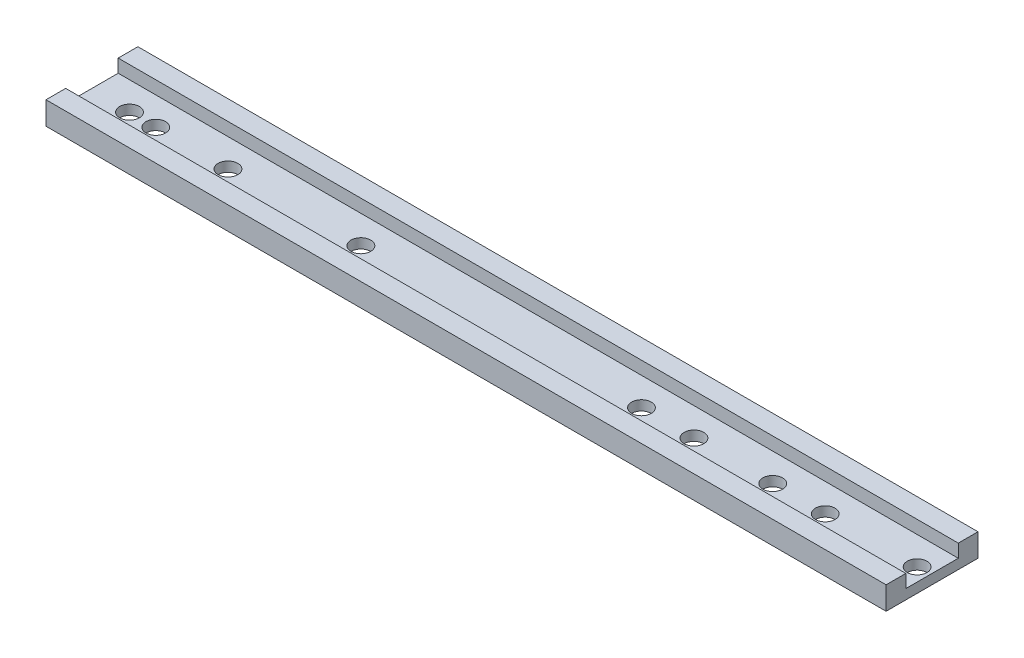
ISO-10303-21;
HEADER;
FILE_DESCRIPTION(('STEP AP214'),'2;1');
FILE_NAME('part.step','',(''),(''),'','','');
FILE_SCHEMA(('AUTOMOTIVE_DESIGN { 1 0 10303 214 1 1 1 1 }'));
ENDSEC;
DATA;
#1=APPLICATION_CONTEXT('core data for automotive mechanical design processes');
#2=APPLICATION_PROTOCOL_DEFINITION('international standard','automotive_design',2000,#1);
#3=PRODUCT_CONTEXT('',#1,'mechanical');
#4=PRODUCT('Part','Part','',(#3));
#5=PRODUCT_RELATED_PRODUCT_CATEGORY('part','',(#4));
#6=PRODUCT_DEFINITION_FORMATION('','',#4);
#7=PRODUCT_DEFINITION_CONTEXT('part definition',#1,'design');
#8=PRODUCT_DEFINITION('design','',#6,#7);
#9=PRODUCT_DEFINITION_SHAPE('','',#8);
#10=(LENGTH_UNIT() NAMED_UNIT(*) SI_UNIT(.MILLI.,.METRE.));
#11=(NAMED_UNIT(*) PLANE_ANGLE_UNIT() SI_UNIT($,.RADIAN.));
#12=(NAMED_UNIT(*) SI_UNIT($,.STERADIAN.) SOLID_ANGLE_UNIT());
#13=UNCERTAINTY_MEASURE_WITH_UNIT(LENGTH_MEASURE(1.E-05),#10,'distance_accuracy_value','');
#14=(GEOMETRIC_REPRESENTATION_CONTEXT(3) GLOBAL_UNCERTAINTY_ASSIGNED_CONTEXT((#13)) GLOBAL_UNIT_ASSIGNED_CONTEXT((#10,
#11,#12)) REPRESENTATION_CONTEXT('',''));
#15=CARTESIAN_POINT('',(0.,0.,0.));
#16=DIRECTION('',(0.,0.,1.));
#17=DIRECTION('',(1.,0.,0.));
#18=AXIS2_PLACEMENT_3D('',#15,#16,#17);
#19=CARTESIAN_POINT('',(211.2,6.88409090909091,11.825));
#20=DIRECTION('',(0.,-1.,0.));
#21=DIRECTION('',(0.,0.,-1.));
#22=AXIS2_PLACEMENT_3D('',#19,#20,#21);
#23=PLANE('',#22);
#24=DIRECTION('',(0.,0.,1.));
#25=VECTOR('',#24,1.);
#26=CARTESIAN_POINT('',(-195.2,6.88409090909091,11.825));
#27=LINE('',#26,#25);
#28=CARTESIAN_POINT('',(-195.2,6.88409090909091,11.825));
#29=VERTEX_POINT('',#28);
#30=CARTESIAN_POINT('',(-195.2,6.88409090909091,21.35));
#31=VERTEX_POINT('',#30);
#32=EDGE_CURVE('E133',#29,#31,#27,.T.);
#33=ORIENTED_EDGE('',*,*,#32,.T.);
#34=DIRECTION('',(-1.,0.,0.));
#35=VECTOR('',#34,1.);
#36=CARTESIAN_POINT('',(211.2,6.88409090909091,21.35));
#37=LINE('',#36,#35);
#38=CARTESIAN_POINT('',(211.2,6.88409090909091,21.35));
#39=VERTEX_POINT('',#38);
#40=EDGE_CURVE('E11',#39,#31,#37,.T.);
#41=ORIENTED_EDGE('',*,*,#40,.F.);
#42=DIRECTION('',(0.,0.,1.));
#43=VECTOR('',#42,1.);
#44=CARTESIAN_POINT('',(211.2,6.88409090909091,11.825));
#45=LINE('',#44,#43);
#46=CARTESIAN_POINT('',(211.2,6.88409090909091,11.825));
#47=VERTEX_POINT('',#46);
#48=EDGE_CURVE('E148',#47,#39,#45,.T.);
#49=ORIENTED_EDGE('',*,*,#48,.F.);
#50=DIRECTION('',(-1.,0.,0.));
#51=VECTOR('',#50,1.);
#52=CARTESIAN_POINT('',(211.2,6.88409090909091,11.825));
#53=LINE('',#52,#51);
#54=EDGE_CURVE('E129',#47,#29,#53,.T.);
#55=ORIENTED_EDGE('',*,*,#54,.T.);
#56=EDGE_LOOP('',(#33,#41,#49,#55));
#57=FACE_BOUND('',#56,.T.);
#58=ADVANCED_FACE('F35',(#57),#23,.F.);
#59=CARTESIAN_POINT('',(211.2,6.88409090909091,21.35));
#60=DIRECTION('',(0.,0.,-1.));
#61=DIRECTION('',(-1.,0.,0.));
#62=AXIS2_PLACEMENT_3D('',#59,#60,#61);
#63=PLANE('',#62);
#64=DIRECTION('',(0.,-1.,0.));
#65=VECTOR('',#64,1.);
#66=CARTESIAN_POINT('',(-195.2,6.88409090909091,21.35));
#67=LINE('',#66,#65);
#68=CARTESIAN_POINT('',(-195.2,-4.22840909090909,21.35));
#69=VERTEX_POINT('',#68);
#70=EDGE_CURVE('E136',#31,#69,#67,.T.);
#71=ORIENTED_EDGE('',*,*,#70,.T.);
#72=DIRECTION('',(-1.,0.,0.));
#73=VECTOR('',#72,1.);
#74=CARTESIAN_POINT('',(211.2,-4.22840909090909,21.35));
#75=LINE('',#74,#73);
#76=CARTESIAN_POINT('',(211.2,-4.22840909090909,21.35));
#77=VERTEX_POINT('',#76);
#78=EDGE_CURVE('E44',#77,#69,#75,.T.);
#79=ORIENTED_EDGE('',*,*,#78,.F.);
#80=DIRECTION('',(0.,-1.,0.));
#81=VECTOR('',#80,1.);
#82=CARTESIAN_POINT('',(211.2,6.88409090909091,21.35));
#83=LINE('',#82,#81);
#84=EDGE_CURVE('E96',#39,#77,#83,.T.);
#85=ORIENTED_EDGE('',*,*,#84,.F.);
#86=ORIENTED_EDGE('',*,*,#40,.T.);
#87=EDGE_LOOP('',(#71,#79,#85,#86));
#88=FACE_BOUND('',#87,.T.);
#89=ADVANCED_FACE('F247',(#88),#63,.F.);
#90=CARTESIAN_POINT('',(211.2,-4.22840909090909,21.35));
#91=DIRECTION('',(0.,1.,0.));
#92=DIRECTION('',(0.,0.,1.));
#93=AXIS2_PLACEMENT_3D('',#90,#91,#92);
#94=PLANE('',#93);
#95=CARTESIAN_POINT('',(204.85,-4.22840909090909,0.));
#96=DIRECTION('',(0.,-1.,0.));
#97=DIRECTION('',(0.,0.,-1.));
#98=AXIS2_PLACEMENT_3D('',#95,#96,#97);
#99=CIRCLE('',#98,4.76250000000001);
#100=CARTESIAN_POINT('',(204.85,-4.22840909090909,-4.76250000000001));
#101=VERTEX_POINT('',#100);
#102=EDGE_CURVE('E198',#101,#101,#99,.T.);
#103=ORIENTED_EDGE('',*,*,#102,.F.);
#104=EDGE_LOOP('',(#103));
#105=FACE_BOUND('',#104,.T.);
#106=CARTESIAN_POINT('',(160.4,-4.22840909090909,0.));
#107=DIRECTION('',(0.,-1.,0.));
#108=DIRECTION('',(0.,0.,-1.));
#109=AXIS2_PLACEMENT_3D('',#106,#107,#108);
#110=CIRCLE('',#109,4.76250000000001);
#111=CARTESIAN_POINT('',(160.4,-4.22840909090909,-4.76250000000001));
#112=VERTEX_POINT('',#111);
#113=EDGE_CURVE('E188',#112,#112,#110,.T.);
#114=ORIENTED_EDGE('',*,*,#113,.F.);
#115=EDGE_LOOP('',(#114));
#116=FACE_BOUND('',#115,.T.);
#117=CARTESIAN_POINT('',(135.,-4.22840909090909,0.));
#118=DIRECTION('',(0.,-1.,0.));
#119=DIRECTION('',(0.,0.,-1.));
#120=AXIS2_PLACEMENT_3D('',#117,#118,#119);
#121=CIRCLE('',#120,4.76250000000001);
#122=CARTESIAN_POINT('',(135.,-4.22840909090909,-4.76250000000001));
#123=VERTEX_POINT('',#122);
#124=EDGE_CURVE('E185',#123,#123,#121,.T.);
#125=ORIENTED_EDGE('',*,*,#124,.F.);
#126=EDGE_LOOP('',(#125));
#127=FACE_BOUND('',#126,.T.);
#128=CARTESIAN_POINT('',(96.9,-4.22840909090909,0.));
#129=DIRECTION('',(0.,-1.,0.));
#130=DIRECTION('',(0.,0.,-1.));
#131=AXIS2_PLACEMENT_3D('',#128,#129,#130);
#132=CIRCLE('',#131,4.7625);
#133=CARTESIAN_POINT('',(96.9,-4.22840909090909,-4.7625));
#134=VERTEX_POINT('',#133);
#135=EDGE_CURVE('E182',#134,#134,#132,.T.);
#136=ORIENTED_EDGE('',*,*,#135,.F.);
#137=EDGE_LOOP('',(#136));
#138=FACE_BOUND('',#137,.T.);
#139=CARTESIAN_POINT('',(71.5,-4.22840909090909,0.));
#140=DIRECTION('',(0.,-1.,0.));
#141=DIRECTION('',(0.,0.,-1.));
#142=AXIS2_PLACEMENT_3D('',#139,#140,#141);
#143=CIRCLE('',#142,4.7625);
#144=CARTESIAN_POINT('',(71.5,-4.22840909090909,-4.7625));
#145=VERTEX_POINT('',#144);
#146=EDGE_CURVE('E178',#145,#145,#143,.T.);
#147=ORIENTED_EDGE('',*,*,#146,.F.);
#148=EDGE_LOOP('',(#147));
#149=FACE_BOUND('',#148,.T.);
#150=CARTESIAN_POINT('',(-64.23125,-4.22840909090909,0.));
#151=DIRECTION('',(0.,-1.,0.));
#152=DIRECTION('',(0.,0.,-1.));
#153=AXIS2_PLACEMENT_3D('',#150,#151,#152);
#154=CIRCLE('',#153,4.7625);
#155=CARTESIAN_POINT('',(-64.23125,-4.22840909090909,-4.7625));
#156=VERTEX_POINT('',#155);
#157=EDGE_CURVE('E174',#156,#156,#154,.T.);
#158=ORIENTED_EDGE('',*,*,#157,.F.);
#159=EDGE_LOOP('',(#158));
#160=FACE_BOUND('',#159,.T.);
#161=CARTESIAN_POINT('',(-128.525,-4.22840909090909,0.));
#162=DIRECTION('',(0.,-1.,0.));
#163=DIRECTION('',(0.,0.,-1.));
#164=AXIS2_PLACEMENT_3D('',#161,#162,#163);
#165=CIRCLE('',#164,4.7625);
#166=CARTESIAN_POINT('',(-128.525,-4.22840909090909,-4.7625));
#167=VERTEX_POINT('',#166);
#168=EDGE_CURVE('E170',#167,#167,#165,.T.);
#169=ORIENTED_EDGE('',*,*,#168,.F.);
#170=EDGE_LOOP('',(#169));
#171=FACE_BOUND('',#170,.T.);
#172=CARTESIAN_POINT('',(-163.45,-4.22840909090909,0.));
#173=DIRECTION('',(0.,-1.,0.));
#174=DIRECTION('',(0.,0.,-1.));
#175=AXIS2_PLACEMENT_3D('',#172,#173,#174);
#176=CIRCLE('',#175,4.76250000000001);
#177=CARTESIAN_POINT('',(-163.45,-4.22840909090909,-4.76250000000001));
#178=VERTEX_POINT('',#177);
#179=EDGE_CURVE('E166',#178,#178,#176,.T.);
#180=ORIENTED_EDGE('',*,*,#179,.F.);
#181=EDGE_LOOP('',(#180));
#182=FACE_BOUND('',#181,.T.);
#183=CARTESIAN_POINT('',(-176.15,-4.22840909090909,0.));
#184=DIRECTION('',(0.,-1.,0.));
#185=DIRECTION('',(0.,0.,-1.));
#186=AXIS2_PLACEMENT_3D('',#183,#184,#185);
#187=CIRCLE('',#186,4.76250000000001);
#188=CARTESIAN_POINT('',(-176.15,-4.22840909090909,-4.76250000000001));
#189=VERTEX_POINT('',#188);
#190=EDGE_CURVE('E162',#189,#189,#187,.T.);
#191=ORIENTED_EDGE('',*,*,#190,.F.);
#192=EDGE_LOOP('',(#191));
#193=FACE_BOUND('',#192,.T.);
#194=DIRECTION('',(0.,0.,-1.));
#195=VECTOR('',#194,1.);
#196=CARTESIAN_POINT('',(-195.2,-4.22840909090909,21.35));
#197=LINE('',#196,#195);
#198=CARTESIAN_POINT('',(-195.2,-4.22840909090909,-23.1));
#199=VERTEX_POINT('',#198);
#200=EDGE_CURVE('E139',#69,#199,#197,.T.);
#201=ORIENTED_EDGE('',*,*,#200,.T.);
#202=DIRECTION('',(-1.,0.,0.));
#203=VECTOR('',#202,1.);
#204=CARTESIAN_POINT('',(211.2,-4.22840909090909,-23.1));
#205=LINE('',#204,#203);
#206=CARTESIAN_POINT('',(211.2,-4.22840909090909,-23.1));
#207=VERTEX_POINT('',#206);
#208=EDGE_CURVE('E155',#207,#199,#205,.T.);
#209=ORIENTED_EDGE('',*,*,#208,.F.);
#210=DIRECTION('',(0.,0.,-1.));
#211=VECTOR('',#210,1.);
#212=CARTESIAN_POINT('',(211.2,-4.22840909090909,21.35));
#213=LINE('',#212,#211);
#214=EDGE_CURVE('E215',#77,#207,#213,.T.);
#215=ORIENTED_EDGE('',*,*,#214,.F.);
#216=ORIENTED_EDGE('',*,*,#78,.T.);
#217=EDGE_LOOP('',(#201,#209,#215,#216));
#218=FACE_BOUND('',#217,.T.);
#219=ADVANCED_FACE('F251',(#105,#116,#127,#138,#149,#160,#171,#182,#193,#218),#94,.F.);
#220=CARTESIAN_POINT('',(211.2,-4.22840909090909,-23.1));
#221=DIRECTION('',(0.,0.,1.));
#222=DIRECTION('',(0.,-1.,0.));
#223=AXIS2_PLACEMENT_3D('',#220,#221,#222);
#224=PLANE('',#223);
#225=DIRECTION('',(0.,1.,0.));
#226=VECTOR('',#225,1.);
#227=CARTESIAN_POINT('',(-195.2,-4.22840909090909,-23.1));
#228=LINE('',#227,#226);
#229=CARTESIAN_POINT('',(-195.2,6.88409090909091,-23.1));
#230=VERTEX_POINT('',#229);
#231=EDGE_CURVE('E141',#199,#230,#228,.T.);
#232=ORIENTED_EDGE('',*,*,#231,.T.);
#233=DIRECTION('',(-1.,0.,0.));
#234=VECTOR('',#233,1.);
#235=CARTESIAN_POINT('',(211.2,6.88409090909091,-23.1));
#236=LINE('',#235,#234);
#237=CARTESIAN_POINT('',(211.2,6.88409090909091,-23.1));
#238=VERTEX_POINT('',#237);
#239=EDGE_CURVE('E152',#238,#230,#236,.T.);
#240=ORIENTED_EDGE('',*,*,#239,.F.);
#241=DIRECTION('',(0.,1.,0.));
#242=VECTOR('',#241,1.);
#243=CARTESIAN_POINT('',(211.2,-4.22840909090909,-23.1));
#244=LINE('',#243,#242);
#245=EDGE_CURVE('E217',#207,#238,#244,.T.);
#246=ORIENTED_EDGE('',*,*,#245,.F.);
#247=ORIENTED_EDGE('',*,*,#208,.T.);
#248=EDGE_LOOP('',(#232,#240,#246,#247));
#249=FACE_BOUND('',#248,.T.);
#250=ADVANCED_FACE('F223',(#249),#224,.F.);
#251=CARTESIAN_POINT('',(211.2,6.88409090909091,-23.1));
#252=DIRECTION('',(0.,-1.,0.));
#253=DIRECTION('',(0.,0.,-1.));
#254=AXIS2_PLACEMENT_3D('',#251,#252,#253);
#255=PLANE('',#254);
#256=DIRECTION('',(0.,0.,1.));
#257=VECTOR('',#256,1.);
#258=CARTESIAN_POINT('',(-195.2,6.88409090909091,-23.1));
#259=LINE('',#258,#257);
#260=CARTESIAN_POINT('',(-195.2,6.88409090909091,-13.575));
#261=VERTEX_POINT('',#260);
#262=EDGE_CURVE('E143',#230,#261,#259,.T.);
#263=ORIENTED_EDGE('',*,*,#262,.T.);
#264=DIRECTION('',(-1.,0.,0.));
#265=VECTOR('',#264,1.);
#266=CARTESIAN_POINT('',(211.2,6.88409090909091,-13.575));
#267=LINE('',#266,#265);
#268=CARTESIAN_POINT('',(211.2,6.88409090909091,-13.575));
#269=VERTEX_POINT('',#268);
#270=EDGE_CURVE('E124',#269,#261,#267,.T.);
#271=ORIENTED_EDGE('',*,*,#270,.F.);
#272=DIRECTION('',(0.,0.,1.));
#273=VECTOR('',#272,1.);
#274=CARTESIAN_POINT('',(211.2,6.88409090909091,-23.1));
#275=LINE('',#274,#273);
#276=EDGE_CURVE('E115',#238,#269,#275,.T.);
#277=ORIENTED_EDGE('',*,*,#276,.F.);
#278=ORIENTED_EDGE('',*,*,#239,.T.);
#279=EDGE_LOOP('',(#263,#271,#277,#278));
#280=FACE_BOUND('',#279,.T.);
#281=ADVANCED_FACE('F227',(#280),#255,.F.);
#282=CARTESIAN_POINT('',(211.2,6.88409090909091,-13.575));
#283=DIRECTION('',(0.,0.,-1.));
#284=DIRECTION('',(0.,1.,0.));
#285=AXIS2_PLACEMENT_3D('',#282,#283,#284);
#286=PLANE('',#285);
#287=DIRECTION('',(0.,-1.,0.));
#288=VECTOR('',#287,1.);
#289=CARTESIAN_POINT('',(-195.2,6.88409090909091,-13.575));
#290=LINE('',#289,#288);
#291=CARTESIAN_POINT('',(-195.2,0.534090909090912,-13.575));
#292=VERTEX_POINT('',#291);
#293=EDGE_CURVE('E123',#261,#292,#290,.T.);
#294=ORIENTED_EDGE('',*,*,#293,.T.);
#295=DIRECTION('',(-1.,0.,0.));
#296=VECTOR('',#295,1.);
#297=CARTESIAN_POINT('',(211.2,0.534090909090912,-13.575));
#298=LINE('',#297,#296);
#299=CARTESIAN_POINT('',(211.2,0.534090909090912,-13.575));
#300=VERTEX_POINT('',#299);
#301=EDGE_CURVE('E120',#300,#292,#298,.T.);
#302=ORIENTED_EDGE('',*,*,#301,.F.);
#303=DIRECTION('',(0.,-1.,0.));
#304=VECTOR('',#303,1.);
#305=CARTESIAN_POINT('',(211.2,6.88409090909091,-13.575));
#306=LINE('',#305,#304);
#307=EDGE_CURVE('E109',#269,#300,#306,.T.);
#308=ORIENTED_EDGE('',*,*,#307,.F.);
#309=ORIENTED_EDGE('',*,*,#270,.T.);
#310=EDGE_LOOP('',(#294,#302,#308,#309));
#311=FACE_BOUND('',#310,.T.);
#312=ADVANCED_FACE('F121',(#311),#286,.F.);
#313=CARTESIAN_POINT('',(211.2,0.534090909090912,-13.575));
#314=DIRECTION('',(0.,-1.,0.));
#315=DIRECTION('',(0.,0.,-1.));
#316=AXIS2_PLACEMENT_3D('',#313,#314,#315);
#317=PLANE('',#316);
#318=CARTESIAN_POINT('',(204.85,0.53409090909091,0.));
#319=DIRECTION('',(0.,-1.,0.));
#320=DIRECTION('',(0.,0.,-1.));
#321=AXIS2_PLACEMENT_3D('',#318,#319,#320);
#322=CIRCLE('',#321,4.76250000000001);
#323=CARTESIAN_POINT('',(204.85,0.534090909090911,-4.76250000000001));
#324=VERTEX_POINT('',#323);
#325=EDGE_CURVE('E38',#324,#324,#322,.T.);
#326=ORIENTED_EDGE('',*,*,#325,.T.);
#327=EDGE_LOOP('',(#326));
#328=FACE_BOUND('',#327,.T.);
#329=CARTESIAN_POINT('',(160.4,0.53409090909091,0.));
#330=DIRECTION('',(0.,-1.,0.));
#331=DIRECTION('',(0.,0.,-1.));
#332=AXIS2_PLACEMENT_3D('',#329,#330,#331);
#333=CIRCLE('',#332,4.76250000000001);
#334=CARTESIAN_POINT('',(160.4,0.534090909090911,-4.76250000000001));
#335=VERTEX_POINT('',#334);
#336=EDGE_CURVE('E186',#335,#335,#333,.T.);
#337=ORIENTED_EDGE('',*,*,#336,.T.);
#338=EDGE_LOOP('',(#337));
#339=FACE_BOUND('',#338,.T.);
#340=CARTESIAN_POINT('',(135.,0.53409090909091,0.));
#341=DIRECTION('',(0.,-1.,0.));
#342=DIRECTION('',(0.,0.,-1.));
#343=AXIS2_PLACEMENT_3D('',#340,#341,#342);
#344=CIRCLE('',#343,4.76250000000001);
#345=CARTESIAN_POINT('',(135.,0.534090909090911,-4.76250000000001));
#346=VERTEX_POINT('',#345);
#347=EDGE_CURVE('E183',#346,#346,#344,.T.);
#348=ORIENTED_EDGE('',*,*,#347,.T.);
#349=EDGE_LOOP('',(#348));
#350=FACE_BOUND('',#349,.T.);
#351=CARTESIAN_POINT('',(96.9,0.53409090909091,0.));
#352=DIRECTION('',(0.,-1.,0.));
#353=DIRECTION('',(0.,0.,-1.));
#354=AXIS2_PLACEMENT_3D('',#351,#352,#353);
#355=CIRCLE('',#354,4.7625);
#356=CARTESIAN_POINT('',(96.9,0.534090909090911,-4.7625));
#357=VERTEX_POINT('',#356);
#358=EDGE_CURVE('E179',#357,#357,#355,.T.);
#359=ORIENTED_EDGE('',*,*,#358,.T.);
#360=EDGE_LOOP('',(#359));
#361=FACE_BOUND('',#360,.T.);
#362=CARTESIAN_POINT('',(71.5,0.53409090909091,0.));
#363=DIRECTION('',(0.,-1.,0.));
#364=DIRECTION('',(0.,0.,-1.));
#365=AXIS2_PLACEMENT_3D('',#362,#363,#364);
#366=CIRCLE('',#365,4.7625);
#367=CARTESIAN_POINT('',(71.5,0.534090909090911,-4.7625));
#368=VERTEX_POINT('',#367);
#369=EDGE_CURVE('E175',#368,#368,#366,.T.);
#370=ORIENTED_EDGE('',*,*,#369,.T.);
#371=EDGE_LOOP('',(#370));
#372=FACE_BOUND('',#371,.T.);
#373=CARTESIAN_POINT('',(-64.23125,0.53409090909091,0.));
#374=DIRECTION('',(0.,-1.,0.));
#375=DIRECTION('',(0.,0.,-1.));
#376=AXIS2_PLACEMENT_3D('',#373,#374,#375);
#377=CIRCLE('',#376,4.7625);
#378=CARTESIAN_POINT('',(-64.23125,0.534090909090911,-4.7625));
#379=VERTEX_POINT('',#378);
#380=EDGE_CURVE('E171',#379,#379,#377,.T.);
#381=ORIENTED_EDGE('',*,*,#380,.T.);
#382=EDGE_LOOP('',(#381));
#383=FACE_BOUND('',#382,.T.);
#384=CARTESIAN_POINT('',(-128.525,0.53409090909091,0.));
#385=DIRECTION('',(0.,-1.,0.));
#386=DIRECTION('',(0.,0.,-1.));
#387=AXIS2_PLACEMENT_3D('',#384,#385,#386);
#388=CIRCLE('',#387,4.7625);
#389=CARTESIAN_POINT('',(-128.525,0.534090909090911,-4.7625));
#390=VERTEX_POINT('',#389);
#391=EDGE_CURVE('E167',#390,#390,#388,.T.);
#392=ORIENTED_EDGE('',*,*,#391,.T.);
#393=EDGE_LOOP('',(#392));
#394=FACE_BOUND('',#393,.T.);
#395=CARTESIAN_POINT('',(-163.45,0.53409090909091,0.));
#396=DIRECTION('',(0.,-1.,0.));
#397=DIRECTION('',(0.,0.,-1.));
#398=AXIS2_PLACEMENT_3D('',#395,#396,#397);
#399=CIRCLE('',#398,4.76250000000001);
#400=CARTESIAN_POINT('',(-163.45,0.534090909090911,-4.76250000000001));
#401=VERTEX_POINT('',#400);
#402=EDGE_CURVE('E163',#401,#401,#399,.T.);
#403=ORIENTED_EDGE('',*,*,#402,.T.);
#404=EDGE_LOOP('',(#403));
#405=FACE_BOUND('',#404,.T.);
#406=CARTESIAN_POINT('',(-176.15,0.53409090909091,0.));
#407=DIRECTION('',(0.,-1.,0.));
#408=DIRECTION('',(0.,0.,-1.));
#409=AXIS2_PLACEMENT_3D('',#406,#407,#408);
#410=CIRCLE('',#409,4.76250000000001);
#411=CARTESIAN_POINT('',(-176.15,0.534090909090911,-4.76250000000001));
#412=VERTEX_POINT('',#411);
#413=EDGE_CURVE('E137',#412,#412,#410,.T.);
#414=ORIENTED_EDGE('',*,*,#413,.T.);
#415=EDGE_LOOP('',(#414));
#416=FACE_BOUND('',#415,.T.);
#417=DIRECTION('',(0.,0.,1.));
#418=VECTOR('',#417,1.);
#419=CARTESIAN_POINT('',(-195.2,0.534090909090912,-13.575));
#420=LINE('',#419,#418);
#421=CARTESIAN_POINT('',(-195.2,0.534090909090908,11.825));
#422=VERTEX_POINT('',#421);
#423=EDGE_CURVE('E82',#292,#422,#420,.T.);
#424=ORIENTED_EDGE('',*,*,#423,.T.);
#425=DIRECTION('',(-1.,0.,0.));
#426=VECTOR('',#425,1.);
#427=CARTESIAN_POINT('',(211.2,0.534090909090908,11.825));
#428=LINE('',#427,#426);
#429=CARTESIAN_POINT('',(211.2,0.534090909090908,11.825));
#430=VERTEX_POINT('',#429);
#431=EDGE_CURVE('E125',#430,#422,#428,.T.);
#432=ORIENTED_EDGE('',*,*,#431,.F.);
#433=DIRECTION('',(0.,0.,1.));
#434=VECTOR('',#433,1.);
#435=CARTESIAN_POINT('',(211.2,0.534090909090912,-13.575));
#436=LINE('',#435,#434);
#437=EDGE_CURVE('E113',#300,#430,#436,.T.);
#438=ORIENTED_EDGE('',*,*,#437,.F.);
#439=ORIENTED_EDGE('',*,*,#301,.T.);
#440=EDGE_LOOP('',(#424,#432,#438,#439));
#441=FACE_BOUND('',#440,.T.);
#442=ADVANCED_FACE('F127',(#328,#339,#350,#361,#372,#383,#394,#405,#416,#441),#317,.F.);
#443=CARTESIAN_POINT('',(211.2,0.534090909090908,11.825));
#444=DIRECTION('',(0.,0.,1.));
#445=DIRECTION('',(0.,-1.,0.));
#446=AXIS2_PLACEMENT_3D('',#443,#444,#445);
#447=PLANE('',#446);
#448=DIRECTION('',(0.,1.,0.));
#449=VECTOR('',#448,1.);
#450=CARTESIAN_POINT('',(-195.2,0.534090909090908,11.825));
#451=LINE('',#450,#449);
#452=EDGE_CURVE('E88',#422,#29,#451,.T.);
#453=ORIENTED_EDGE('',*,*,#452,.T.);
#454=ORIENTED_EDGE('',*,*,#54,.F.);
#455=DIRECTION('',(0.,1.,0.));
#456=VECTOR('',#455,1.);
#457=CARTESIAN_POINT('',(211.2,0.534090909090908,11.825));
#458=LINE('',#457,#456);
#459=EDGE_CURVE('E53',#430,#47,#458,.T.);
#460=ORIENTED_EDGE('',*,*,#459,.F.);
#461=ORIENTED_EDGE('',*,*,#431,.T.);
#462=EDGE_LOOP('',(#453,#454,#460,#461));
#463=FACE_BOUND('',#462,.T.);
#464=ADVANCED_FACE('F235',(#463),#447,.F.);
#465=CARTESIAN_POINT('',(211.2,-4.22840909090909,21.35));
#466=DIRECTION('',(1.,0.,0.));
#467=DIRECTION('',(0.,0.,-1.));
#468=AXIS2_PLACEMENT_3D('',#465,#466,#467);
#469=PLANE('',#468);
#470=ORIENTED_EDGE('',*,*,#48,.T.);
#471=ORIENTED_EDGE('',*,*,#84,.T.);
#472=ORIENTED_EDGE('',*,*,#214,.T.);
#473=ORIENTED_EDGE('',*,*,#245,.T.);
#474=ORIENTED_EDGE('',*,*,#276,.T.);
#475=ORIENTED_EDGE('',*,*,#307,.T.);
#476=ORIENTED_EDGE('',*,*,#437,.T.);
#477=ORIENTED_EDGE('',*,*,#459,.T.);
#478=EDGE_LOOP('',(#470,#471,#472,#473,#474,#475,#476,#477));
#479=FACE_BOUND('',#478,.T.);
#480=ADVANCED_FACE('F111',(#479),#469,.T.);
#481=CARTESIAN_POINT('',(-195.2,-4.22840909090909,21.35));
#482=DIRECTION('',(1.,0.,0.));
#483=DIRECTION('',(0.,0.,-1.));
#484=AXIS2_PLACEMENT_3D('',#481,#482,#483);
#485=PLANE('',#484);
#486=ORIENTED_EDGE('',*,*,#32,.F.);
#487=ORIENTED_EDGE('',*,*,#452,.F.);
#488=ORIENTED_EDGE('',*,*,#423,.F.);
#489=ORIENTED_EDGE('',*,*,#293,.F.);
#490=ORIENTED_EDGE('',*,*,#262,.F.);
#491=ORIENTED_EDGE('',*,*,#231,.F.);
#492=ORIENTED_EDGE('',*,*,#200,.F.);
#493=ORIENTED_EDGE('',*,*,#70,.F.);
#494=EDGE_LOOP('',(#486,#487,#488,#489,#490,#491,#492,#493));
#495=FACE_BOUND('',#494,.T.);
#496=ADVANCED_FACE('F230',(#495),#485,.F.);
#497=CARTESIAN_POINT('',(-176.15,6.88409090909091,0.));
#498=DIRECTION('',(0.,-1.,0.));
#499=DIRECTION('',(0.,0.,-1.));
#500=AXIS2_PLACEMENT_3D('',#497,#498,#499);
#501=CYLINDRICAL_SURFACE('',#500,4.76250000000001);
#502=ORIENTED_EDGE('',*,*,#190,.T.);
#503=EDGE_LOOP('',(#502));
#504=FACE_BOUND('',#503,.T.);
#505=ORIENTED_EDGE('',*,*,#413,.F.);
#506=EDGE_LOOP('',(#505));
#507=FACE_BOUND('',#506,.T.);
#508=ADVANCED_FACE('F281',(#504,#507),#501,.F.);
#509=CARTESIAN_POINT('',(-163.45,6.88409090909091,0.));
#510=DIRECTION('',(0.,-1.,0.));
#511=DIRECTION('',(0.,0.,-1.));
#512=AXIS2_PLACEMENT_3D('',#509,#510,#511);
#513=CYLINDRICAL_SURFACE('',#512,4.76250000000001);
#514=ORIENTED_EDGE('',*,*,#179,.T.);
#515=EDGE_LOOP('',(#514));
#516=FACE_BOUND('',#515,.T.);
#517=ORIENTED_EDGE('',*,*,#402,.F.);
#518=EDGE_LOOP('',(#517));
#519=FACE_BOUND('',#518,.T.);
#520=ADVANCED_FACE('F286',(#516,#519),#513,.F.);
#521=CARTESIAN_POINT('',(-128.525,6.88409090909091,0.));
#522=DIRECTION('',(0.,-1.,0.));
#523=DIRECTION('',(0.,0.,-1.));
#524=AXIS2_PLACEMENT_3D('',#521,#522,#523);
#525=CYLINDRICAL_SURFACE('',#524,4.7625);
#526=ORIENTED_EDGE('',*,*,#168,.T.);
#527=EDGE_LOOP('',(#526));
#528=FACE_BOUND('',#527,.T.);
#529=ORIENTED_EDGE('',*,*,#391,.F.);
#530=EDGE_LOOP('',(#529));
#531=FACE_BOUND('',#530,.T.);
#532=ADVANCED_FACE('F298',(#528,#531),#525,.F.);
#533=CARTESIAN_POINT('',(-64.23125,6.88409090909091,0.));
#534=DIRECTION('',(0.,-1.,0.));
#535=DIRECTION('',(0.,0.,-1.));
#536=AXIS2_PLACEMENT_3D('',#533,#534,#535);
#537=CYLINDRICAL_SURFACE('',#536,4.7625);
#538=ORIENTED_EDGE('',*,*,#157,.T.);
#539=EDGE_LOOP('',(#538));
#540=FACE_BOUND('',#539,.T.);
#541=ORIENTED_EDGE('',*,*,#380,.F.);
#542=EDGE_LOOP('',(#541));
#543=FACE_BOUND('',#542,.T.);
#544=ADVANCED_FACE('F308',(#540,#543),#537,.F.);
#545=CARTESIAN_POINT('',(71.5,6.88409090909091,0.));
#546=DIRECTION('',(0.,-1.,0.));
#547=DIRECTION('',(0.,0.,-1.));
#548=AXIS2_PLACEMENT_3D('',#545,#546,#547);
#549=CYLINDRICAL_SURFACE('',#548,4.7625);
#550=ORIENTED_EDGE('',*,*,#146,.T.);
#551=EDGE_LOOP('',(#550));
#552=FACE_BOUND('',#551,.T.);
#553=ORIENTED_EDGE('',*,*,#369,.F.);
#554=EDGE_LOOP('',(#553));
#555=FACE_BOUND('',#554,.T.);
#556=ADVANCED_FACE('F318',(#552,#555),#549,.F.);
#557=CARTESIAN_POINT('',(96.9,6.88409090909091,0.));
#558=DIRECTION('',(0.,-1.,0.));
#559=DIRECTION('',(0.,0.,-1.));
#560=AXIS2_PLACEMENT_3D('',#557,#558,#559);
#561=CYLINDRICAL_SURFACE('',#560,4.7625);
#562=ORIENTED_EDGE('',*,*,#135,.T.);
#563=EDGE_LOOP('',(#562));
#564=FACE_BOUND('',#563,.T.);
#565=ORIENTED_EDGE('',*,*,#358,.F.);
#566=EDGE_LOOP('',(#565));
#567=FACE_BOUND('',#566,.T.);
#568=ADVANCED_FACE('F328',(#564,#567),#561,.F.);
#569=CARTESIAN_POINT('',(135.,6.88409090909091,0.));
#570=DIRECTION('',(0.,-1.,0.));
#571=DIRECTION('',(0.,0.,-1.));
#572=AXIS2_PLACEMENT_3D('',#569,#570,#571);
#573=CYLINDRICAL_SURFACE('',#572,4.76250000000001);
#574=ORIENTED_EDGE('',*,*,#124,.T.);
#575=EDGE_LOOP('',(#574));
#576=FACE_BOUND('',#575,.T.);
#577=ORIENTED_EDGE('',*,*,#347,.F.);
#578=EDGE_LOOP('',(#577));
#579=FACE_BOUND('',#578,.T.);
#580=ADVANCED_FACE('F338',(#576,#579),#573,.F.);
#581=CARTESIAN_POINT('',(160.4,6.88409090909091,0.));
#582=DIRECTION('',(0.,-1.,0.));
#583=DIRECTION('',(0.,0.,-1.));
#584=AXIS2_PLACEMENT_3D('',#581,#582,#583);
#585=CYLINDRICAL_SURFACE('',#584,4.76250000000001);
#586=ORIENTED_EDGE('',*,*,#113,.T.);
#587=EDGE_LOOP('',(#586));
#588=FACE_BOUND('',#587,.T.);
#589=ORIENTED_EDGE('',*,*,#336,.F.);
#590=EDGE_LOOP('',(#589));
#591=FACE_BOUND('',#590,.T.);
#592=ADVANCED_FACE('F348',(#588,#591),#585,.F.);
#593=CARTESIAN_POINT('',(204.85,6.88409090909091,0.));
#594=DIRECTION('',(0.,-1.,0.));
#595=DIRECTION('',(0.,0.,-1.));
#596=AXIS2_PLACEMENT_3D('',#593,#594,#595);
#597=CYLINDRICAL_SURFACE('',#596,4.76250000000001);
#598=ORIENTED_EDGE('',*,*,#102,.T.);
#599=EDGE_LOOP('',(#598));
#600=FACE_BOUND('',#599,.T.);
#601=ORIENTED_EDGE('',*,*,#325,.F.);
#602=EDGE_LOOP('',(#601));
#603=FACE_BOUND('',#602,.T.);
#604=ADVANCED_FACE('F358',(#600,#603),#597,.F.);
#605=CLOSED_SHELL('',(#58,#89,#219,#250,#281,#312,#442,#464,#480,#496,#508,#520,#532,#544,#556,
#568,#580,#592,#604));
#606=MANIFOLD_SOLID_BREP('B2',#605);
#607=ADVANCED_BREP_SHAPE_REPRESENTATION('',(#18,#606),#14);
#608=SHAPE_DEFINITION_REPRESENTATION(#9,#607);
ENDSEC;
END-ISO-10303-21;
